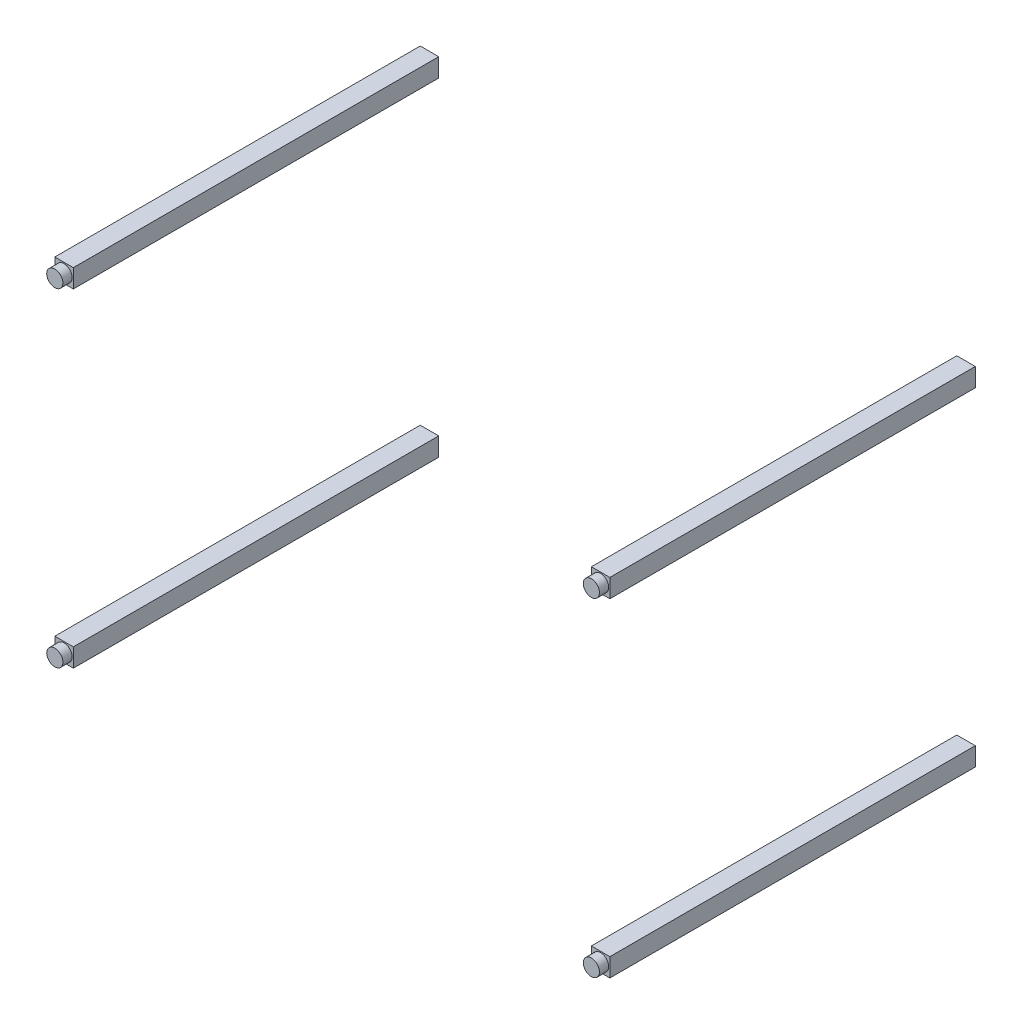
ISO-10303-21;
HEADER;
FILE_DESCRIPTION(('STEP AP214'),'2;1');
FILE_NAME('part.step','',(''),(''),'','','');
FILE_SCHEMA(('AUTOMOTIVE_DESIGN { 1 0 10303 214 1 1 1 1 }'));
ENDSEC;
DATA;
#1=APPLICATION_CONTEXT('core data for automotive mechanical design processes');
#2=APPLICATION_PROTOCOL_DEFINITION('international standard','automotive_design',2000,#1);
#3=PRODUCT_CONTEXT('',#1,'mechanical');
#4=PRODUCT('Part','Part','',(#3));
#5=PRODUCT_RELATED_PRODUCT_CATEGORY('part','',(#4));
#6=PRODUCT_DEFINITION_FORMATION('','',#4);
#7=PRODUCT_DEFINITION_CONTEXT('part definition',#1,'design');
#8=PRODUCT_DEFINITION('design','',#6,#7);
#9=PRODUCT_DEFINITION_SHAPE('','',#8);
#10=(LENGTH_UNIT() NAMED_UNIT(*) SI_UNIT(.MILLI.,.METRE.));
#11=(NAMED_UNIT(*) PLANE_ANGLE_UNIT() SI_UNIT($,.RADIAN.));
#12=(NAMED_UNIT(*) SI_UNIT($,.STERADIAN.) SOLID_ANGLE_UNIT());
#13=UNCERTAINTY_MEASURE_WITH_UNIT(LENGTH_MEASURE(1.E-05),#10,'distance_accuracy_value','');
#14=(GEOMETRIC_REPRESENTATION_CONTEXT(3) GLOBAL_UNCERTAINTY_ASSIGNED_CONTEXT((#13)) GLOBAL_UNIT_ASSIGNED_CONTEXT((#10,
#11,#12)) REPRESENTATION_CONTEXT('',''));
#15=CARTESIAN_POINT('',(0.,0.,0.));
#16=DIRECTION('',(0.,0.,1.));
#17=DIRECTION('',(1.,0.,0.));
#18=AXIS2_PLACEMENT_3D('',#15,#16,#17);
#19=CARTESIAN_POINT('',(-600.,-375.,829.000000000004));
#20=DIRECTION('',(1.,0.,0.));
#21=DIRECTION('',(0.,0.,-1.));
#22=AXIS2_PLACEMENT_3D('',#19,#20,#21);
#23=PLANE('',#22);
#24=DIRECTION('',(0.,-1.,0.));
#25=VECTOR('',#24,1.);
#26=CARTESIAN_POINT('',(-600.,-375.,39.0000000000037));
#27=LINE('',#26,#25);
#28=CARTESIAN_POINT('',(-600.,-335.,39.0000000000037));
#29=VERTEX_POINT('',#28);
#30=CARTESIAN_POINT('',(-600.,-375.,39.0000000000037));
#31=VERTEX_POINT('',#30);
#32=EDGE_CURVE('E59',#29,#31,#27,.T.);
#33=ORIENTED_EDGE('',*,*,#32,.T.);
#34=DIRECTION('',(0.,0.,-1.));
#35=VECTOR('',#34,1.);
#36=CARTESIAN_POINT('',(-600.,-375.,829.000000000004));
#37=LINE('',#36,#35);
#38=CARTESIAN_POINT('',(-600.,-375.,829.000000000004));
#39=VERTEX_POINT('',#38);
#40=EDGE_CURVE('E123',#39,#31,#37,.T.);
#41=ORIENTED_EDGE('',*,*,#40,.F.);
#42=DIRECTION('',(0.,-1.,0.));
#43=VECTOR('',#42,1.);
#44=CARTESIAN_POINT('',(-600.,-375.,829.000000000004));
#45=LINE('',#44,#43);
#46=CARTESIAN_POINT('',(-600.,-335.,829.000000000004));
#47=VERTEX_POINT('',#46);
#48=EDGE_CURVE('E53',#47,#39,#45,.T.);
#49=ORIENTED_EDGE('',*,*,#48,.F.);
#50=DIRECTION('',(0.,0.,-1.));
#51=VECTOR('',#50,1.);
#52=CARTESIAN_POINT('',(-600.,-335.,829.000000000004));
#53=LINE('',#52,#51);
#54=EDGE_CURVE('E109',#47,#29,#53,.T.);
#55=ORIENTED_EDGE('',*,*,#54,.T.);
#56=EDGE_LOOP('',(#33,#41,#49,#55));
#57=FACE_BOUND('',#56,.T.);
#58=ADVANCED_FACE('F49',(#57),#23,.F.);
#59=CARTESIAN_POINT('',(-600.,-375.,829.000000000004));
#60=DIRECTION('',(0.,1.,0.));
#61=DIRECTION('',(0.,0.,1.));
#62=AXIS2_PLACEMENT_3D('',#59,#60,#61);
#63=PLANE('',#62);
#64=DIRECTION('',(1.,0.,0.));
#65=VECTOR('',#64,1.);
#66=CARTESIAN_POINT('',(-600.,-375.,39.0000000000037));
#67=LINE('',#66,#65);
#68=CARTESIAN_POINT('',(-560.,-375.,39.0000000000037));
#69=VERTEX_POINT('',#68);
#70=EDGE_CURVE('E68',#31,#69,#67,.T.);
#71=ORIENTED_EDGE('',*,*,#70,.T.);
#72=DIRECTION('',(0.,0.,-1.));
#73=VECTOR('',#72,1.);
#74=CARTESIAN_POINT('',(-560.,-375.,829.000000000004));
#75=LINE('',#74,#73);
#76=CARTESIAN_POINT('',(-560.,-375.,829.000000000004));
#77=VERTEX_POINT('',#76);
#78=EDGE_CURVE('E105',#77,#69,#75,.T.);
#79=ORIENTED_EDGE('',*,*,#78,.F.);
#80=DIRECTION('',(1.,0.,0.));
#81=VECTOR('',#80,1.);
#82=CARTESIAN_POINT('',(-600.,-375.,829.000000000004));
#83=LINE('',#82,#81);
#84=EDGE_CURVE('E84',#39,#77,#83,.T.);
#85=ORIENTED_EDGE('',*,*,#84,.F.);
#86=ORIENTED_EDGE('',*,*,#40,.T.);
#87=EDGE_LOOP('',(#71,#79,#85,#86));
#88=FACE_BOUND('',#87,.T.);
#89=ADVANCED_FACE('F146',(#88),#63,.F.);
#90=CARTESIAN_POINT('',(-560.,-375.,829.000000000004));
#91=DIRECTION('',(-1.,0.,0.));
#92=DIRECTION('',(0.,0.,1.));
#93=AXIS2_PLACEMENT_3D('',#90,#91,#92);
#94=PLANE('',#93);
#95=DIRECTION('',(0.,1.,0.));
#96=VECTOR('',#95,1.);
#97=CARTESIAN_POINT('',(-560.,-375.,39.0000000000037));
#98=LINE('',#97,#96);
#99=CARTESIAN_POINT('',(-560.,-335.,39.0000000000037));
#100=VERTEX_POINT('',#99);
#101=EDGE_CURVE('E100',#69,#100,#98,.T.);
#102=ORIENTED_EDGE('',*,*,#101,.T.);
#103=DIRECTION('',(0.,0.,-1.));
#104=VECTOR('',#103,1.);
#105=CARTESIAN_POINT('',(-560.,-335.,829.000000000004));
#106=LINE('',#105,#104);
#107=CARTESIAN_POINT('',(-560.,-335.,829.000000000004));
#108=VERTEX_POINT('',#107);
#109=EDGE_CURVE('E103',#108,#100,#106,.T.);
#110=ORIENTED_EDGE('',*,*,#109,.F.);
#111=DIRECTION('',(0.,1.,0.));
#112=VECTOR('',#111,1.);
#113=CARTESIAN_POINT('',(-560.,-375.,829.000000000004));
#114=LINE('',#113,#112);
#115=EDGE_CURVE('E119',#77,#108,#114,.T.);
#116=ORIENTED_EDGE('',*,*,#115,.F.);
#117=ORIENTED_EDGE('',*,*,#78,.T.);
#118=EDGE_LOOP('',(#102,#110,#116,#117));
#119=FACE_BOUND('',#118,.T.);
#120=ADVANCED_FACE('F101',(#119),#94,.F.);
#121=CARTESIAN_POINT('',(-600.,-335.,829.000000000004));
#122=DIRECTION('',(0.,-1.,0.));
#123=DIRECTION('',(0.,0.,-1.));
#124=AXIS2_PLACEMENT_3D('',#121,#122,#123);
#125=PLANE('',#124);
#126=DIRECTION('',(-1.,0.,0.));
#127=VECTOR('',#126,1.);
#128=CARTESIAN_POINT('',(-600.,-335.,39.0000000000037));
#129=LINE('',#128,#127);
#130=EDGE_CURVE('E94',#100,#29,#129,.T.);
#131=ORIENTED_EDGE('',*,*,#130,.T.);
#132=ORIENTED_EDGE('',*,*,#54,.F.);
#133=DIRECTION('',(-1.,0.,0.));
#134=VECTOR('',#133,1.);
#135=CARTESIAN_POINT('',(-600.,-335.,829.000000000004));
#136=LINE('',#135,#134);
#137=EDGE_CURVE('E108',#108,#47,#136,.T.);
#138=ORIENTED_EDGE('',*,*,#137,.F.);
#139=ORIENTED_EDGE('',*,*,#109,.T.);
#140=EDGE_LOOP('',(#131,#132,#138,#139));
#141=FACE_BOUND('',#140,.T.);
#142=ADVANCED_FACE('F107',(#141),#125,.F.);
#143=CARTESIAN_POINT('',(0.,0.,829.000000000004));
#144=DIRECTION('',(0.,0.,-1.));
#145=DIRECTION('',(-1.,0.,0.));
#146=AXIS2_PLACEMENT_3D('',#143,#144,#145);
#147=PLANE('',#146);
#148=CARTESIAN_POINT('',(-580.,-355.,829.000000000004));
#149=DIRECTION('',(0.,0.,1.));
#150=DIRECTION('',(-1.,0.,0.));
#151=AXIS2_PLACEMENT_3D('',#148,#149,#150);
#152=CIRCLE('',#151,17.4999999999999);
#153=CARTESIAN_POINT('',(-597.5,-355.,829.000000000004));
#154=VERTEX_POINT('',#153);
#155=EDGE_CURVE('E12',#154,#154,#152,.T.);
#156=ORIENTED_EDGE('',*,*,#155,.F.);
#157=EDGE_LOOP('',(#156));
#158=FACE_BOUND('',#157,.T.);
#159=ORIENTED_EDGE('',*,*,#48,.T.);
#160=ORIENTED_EDGE('',*,*,#84,.T.);
#161=ORIENTED_EDGE('',*,*,#115,.T.);
#162=ORIENTED_EDGE('',*,*,#137,.T.);
#163=EDGE_LOOP('',(#159,#160,#161,#162));
#164=FACE_BOUND('',#163,.T.);
#165=ADVANCED_FACE('F51',(#158,#164),#147,.F.);
#166=CARTESIAN_POINT('',(0.,0.,39.0000000000037));
#167=DIRECTION('',(0.,0.,-1.));
#168=DIRECTION('',(-1.,0.,0.));
#169=AXIS2_PLACEMENT_3D('',#166,#167,#168);
#170=PLANE('',#169);
#171=ORIENTED_EDGE('',*,*,#32,.F.);
#172=ORIENTED_EDGE('',*,*,#130,.F.);
#173=ORIENTED_EDGE('',*,*,#101,.F.);
#174=ORIENTED_EDGE('',*,*,#70,.F.);
#175=EDGE_LOOP('',(#171,#172,#173,#174));
#176=FACE_BOUND('',#175,.T.);
#177=ADVANCED_FACE('F111',(#176),#170,.T.);
#178=CARTESIAN_POINT('',(-580.,-355.,849.000000000004));
#179=DIRECTION('',(0.,0.,-1.));
#180=DIRECTION('',(-1.,0.,0.));
#181=AXIS2_PLACEMENT_3D('',#178,#179,#180);
#182=CYLINDRICAL_SURFACE('',#181,17.4999999999999);
#183=CARTESIAN_POINT('',(-580.,-355.,849.000000000004));
#184=DIRECTION('',(0.,0.,1.));
#185=DIRECTION('',(-1.,0.,0.));
#186=AXIS2_PLACEMENT_3D('',#183,#184,#185);
#187=CIRCLE('',#186,17.4999999999999);
#188=CARTESIAN_POINT('',(-597.5,-355.,849.000000000004));
#189=VERTEX_POINT('',#188);
#190=EDGE_CURVE('E124',#189,#189,#187,.T.);
#191=ORIENTED_EDGE('',*,*,#190,.F.);
#192=EDGE_LOOP('',(#191));
#193=FACE_BOUND('',#192,.T.);
#194=ORIENTED_EDGE('',*,*,#155,.T.);
#195=EDGE_LOOP('',(#194));
#196=FACE_BOUND('',#195,.T.);
#197=ADVANCED_FACE('F133',(#193,#196),#182,.T.);
#198=CARTESIAN_POINT('',(-580.,-355.,849.000000000004));
#199=DIRECTION('',(0.,0.,-1.));
#200=DIRECTION('',(-1.,0.,0.));
#201=AXIS2_PLACEMENT_3D('',#198,#199,#200);
#202=PLANE('',#201);
#203=ORIENTED_EDGE('',*,*,#190,.T.);
#204=EDGE_LOOP('',(#203));
#205=FACE_BOUND('',#204,.T.);
#206=ADVANCED_FACE('F131',(#205),#202,.F.);
#207=CLOSED_SHELL('',(#58,#89,#120,#142,#165,#177,#197,#206));
#208=MANIFOLD_SOLID_BREP('B2',#207);
#209=CARTESIAN_POINT('',(600.,-375.,829.000000000004));
#210=DIRECTION('',(0.,1.,0.));
#211=DIRECTION('',(0.,0.,1.));
#212=AXIS2_PLACEMENT_3D('',#209,#210,#211);
#213=PLANE('',#212);
#214=DIRECTION('',(1.,0.,0.));
#215=VECTOR('',#214,1.);
#216=CARTESIAN_POINT('',(600.,-375.,39.0000000000037));
#217=LINE('',#216,#215);
#218=CARTESIAN_POINT('',(560.,-375.,39.0000000000037));
#219=VERTEX_POINT('',#218);
#220=CARTESIAN_POINT('',(600.,-375.,39.0000000000037));
#221=VERTEX_POINT('',#220);
#222=EDGE_CURVE('E238',#219,#221,#217,.T.);
#223=ORIENTED_EDGE('',*,*,#222,.T.);
#224=DIRECTION('',(0.,0.,-1.));
#225=VECTOR('',#224,1.);
#226=CARTESIAN_POINT('',(600.,-375.,829.000000000004));
#227=LINE('',#226,#225);
#228=CARTESIAN_POINT('',(600.,-375.,829.000000000004));
#229=VERTEX_POINT('',#228);
#230=EDGE_CURVE('E302',#229,#221,#227,.T.);
#231=ORIENTED_EDGE('',*,*,#230,.F.);
#232=DIRECTION('',(1.,0.,0.));
#233=VECTOR('',#232,1.);
#234=CARTESIAN_POINT('',(600.,-375.,829.000000000004));
#235=LINE('',#234,#233);
#236=CARTESIAN_POINT('',(560.,-375.,829.000000000004));
#237=VERTEX_POINT('',#236);
#238=EDGE_CURVE('E232',#237,#229,#235,.T.);
#239=ORIENTED_EDGE('',*,*,#238,.F.);
#240=DIRECTION('',(0.,0.,-1.));
#241=VECTOR('',#240,1.);
#242=CARTESIAN_POINT('',(560.,-375.,829.000000000004));
#243=LINE('',#242,#241);
#244=EDGE_CURVE('E288',#237,#219,#243,.T.);
#245=ORIENTED_EDGE('',*,*,#244,.T.);
#246=EDGE_LOOP('',(#223,#231,#239,#245));
#247=FACE_BOUND('',#246,.T.);
#248=ADVANCED_FACE('F228',(#247),#213,.F.);
#249=CARTESIAN_POINT('',(600.,-375.,829.000000000004));
#250=DIRECTION('',(-1.,0.,0.));
#251=DIRECTION('',(0.,0.,1.));
#252=AXIS2_PLACEMENT_3D('',#249,#250,#251);
#253=PLANE('',#252);
#254=DIRECTION('',(0.,1.,0.));
#255=VECTOR('',#254,1.);
#256=CARTESIAN_POINT('',(600.,-375.,39.0000000000037));
#257=LINE('',#256,#255);
#258=CARTESIAN_POINT('',(600.,-335.,39.0000000000037));
#259=VERTEX_POINT('',#258);
#260=EDGE_CURVE('E247',#221,#259,#257,.T.);
#261=ORIENTED_EDGE('',*,*,#260,.T.);
#262=DIRECTION('',(0.,0.,-1.));
#263=VECTOR('',#262,1.);
#264=CARTESIAN_POINT('',(600.,-335.,829.000000000004));
#265=LINE('',#264,#263);
#266=CARTESIAN_POINT('',(600.,-335.,829.000000000004));
#267=VERTEX_POINT('',#266);
#268=EDGE_CURVE('E284',#267,#259,#265,.T.);
#269=ORIENTED_EDGE('',*,*,#268,.F.);
#270=DIRECTION('',(0.,1.,0.));
#271=VECTOR('',#270,1.);
#272=CARTESIAN_POINT('',(600.,-375.,829.000000000004));
#273=LINE('',#272,#271);
#274=EDGE_CURVE('E263',#229,#267,#273,.T.);
#275=ORIENTED_EDGE('',*,*,#274,.F.);
#276=ORIENTED_EDGE('',*,*,#230,.T.);
#277=EDGE_LOOP('',(#261,#269,#275,#276));
#278=FACE_BOUND('',#277,.T.);
#279=ADVANCED_FACE('F325',(#278),#253,.F.);
#280=CARTESIAN_POINT('',(600.,-335.,829.000000000004));
#281=DIRECTION('',(0.,-1.,0.));
#282=DIRECTION('',(0.,0.,-1.));
#283=AXIS2_PLACEMENT_3D('',#280,#281,#282);
#284=PLANE('',#283);
#285=DIRECTION('',(-1.,0.,0.));
#286=VECTOR('',#285,1.);
#287=CARTESIAN_POINT('',(600.,-335.,39.0000000000037));
#288=LINE('',#287,#286);
#289=CARTESIAN_POINT('',(560.,-335.,39.0000000000037));
#290=VERTEX_POINT('',#289);
#291=EDGE_CURVE('E279',#259,#290,#288,.T.);
#292=ORIENTED_EDGE('',*,*,#291,.T.);
#293=DIRECTION('',(0.,0.,-1.));
#294=VECTOR('',#293,1.);
#295=CARTESIAN_POINT('',(560.,-335.,829.000000000004));
#296=LINE('',#295,#294);
#297=CARTESIAN_POINT('',(560.,-335.,829.000000000004));
#298=VERTEX_POINT('',#297);
#299=EDGE_CURVE('E282',#298,#290,#296,.T.);
#300=ORIENTED_EDGE('',*,*,#299,.F.);
#301=DIRECTION('',(-1.,0.,0.));
#302=VECTOR('',#301,1.);
#303=CARTESIAN_POINT('',(600.,-335.,829.000000000004));
#304=LINE('',#303,#302);
#305=EDGE_CURVE('E298',#267,#298,#304,.T.);
#306=ORIENTED_EDGE('',*,*,#305,.F.);
#307=ORIENTED_EDGE('',*,*,#268,.T.);
#308=EDGE_LOOP('',(#292,#300,#306,#307));
#309=FACE_BOUND('',#308,.T.);
#310=ADVANCED_FACE('F280',(#309),#284,.F.);
#311=CARTESIAN_POINT('',(560.,-375.,829.000000000004));
#312=DIRECTION('',(1.,0.,0.));
#313=DIRECTION('',(0.,0.,-1.));
#314=AXIS2_PLACEMENT_3D('',#311,#312,#313);
#315=PLANE('',#314);
#316=DIRECTION('',(0.,-1.,0.));
#317=VECTOR('',#316,1.);
#318=CARTESIAN_POINT('',(560.,-375.,39.0000000000037));
#319=LINE('',#318,#317);
#320=EDGE_CURVE('E273',#290,#219,#319,.T.);
#321=ORIENTED_EDGE('',*,*,#320,.T.);
#322=ORIENTED_EDGE('',*,*,#244,.F.);
#323=DIRECTION('',(0.,-1.,0.));
#324=VECTOR('',#323,1.);
#325=CARTESIAN_POINT('',(560.,-375.,829.000000000004));
#326=LINE('',#325,#324);
#327=EDGE_CURVE('E287',#298,#237,#326,.T.);
#328=ORIENTED_EDGE('',*,*,#327,.F.);
#329=ORIENTED_EDGE('',*,*,#299,.T.);
#330=EDGE_LOOP('',(#321,#322,#328,#329));
#331=FACE_BOUND('',#330,.T.);
#332=ADVANCED_FACE('F286',(#331),#315,.F.);
#333=CARTESIAN_POINT('',(0.,0.,829.000000000004));
#334=DIRECTION('',(0.,0.,-1.));
#335=DIRECTION('',(-1.,0.,0.));
#336=AXIS2_PLACEMENT_3D('',#333,#334,#335);
#337=PLANE('',#336);
#338=CARTESIAN_POINT('',(580.,-355.,829.000000000004));
#339=DIRECTION('',(0.,0.,1.));
#340=DIRECTION('',(1.,0.,0.));
#341=AXIS2_PLACEMENT_3D('',#338,#339,#340);
#342=CIRCLE('',#341,17.4999999999999);
#343=CARTESIAN_POINT('',(597.5,-355.,829.000000000004));
#344=VERTEX_POINT('',#343);
#345=EDGE_CURVE('E47',#344,#344,#342,.T.);
#346=ORIENTED_EDGE('',*,*,#345,.F.);
#347=EDGE_LOOP('',(#346));
#348=FACE_BOUND('',#347,.T.);
#349=ORIENTED_EDGE('',*,*,#238,.T.);
#350=ORIENTED_EDGE('',*,*,#274,.T.);
#351=ORIENTED_EDGE('',*,*,#305,.T.);
#352=ORIENTED_EDGE('',*,*,#327,.T.);
#353=EDGE_LOOP('',(#349,#350,#351,#352));
#354=FACE_BOUND('',#353,.T.);
#355=ADVANCED_FACE('F230',(#348,#354),#337,.F.);
#356=CARTESIAN_POINT('',(0.,0.,39.0000000000037));
#357=DIRECTION('',(0.,0.,-1.));
#358=DIRECTION('',(-1.,0.,0.));
#359=AXIS2_PLACEMENT_3D('',#356,#357,#358);
#360=PLANE('',#359);
#361=ORIENTED_EDGE('',*,*,#222,.F.);
#362=ORIENTED_EDGE('',*,*,#320,.F.);
#363=ORIENTED_EDGE('',*,*,#291,.F.);
#364=ORIENTED_EDGE('',*,*,#260,.F.);
#365=EDGE_LOOP('',(#361,#362,#363,#364));
#366=FACE_BOUND('',#365,.T.);
#367=ADVANCED_FACE('F290',(#366),#360,.T.);
#368=CARTESIAN_POINT('',(580.,-355.,849.000000000004));
#369=DIRECTION('',(0.,0.,-1.));
#370=DIRECTION('',(-1.,0.,0.));
#371=AXIS2_PLACEMENT_3D('',#368,#369,#370);
#372=CYLINDRICAL_SURFACE('',#371,17.4999999999999);
#373=CARTESIAN_POINT('',(580.,-355.,849.000000000004));
#374=DIRECTION('',(0.,0.,1.));
#375=DIRECTION('',(1.,0.,0.));
#376=AXIS2_PLACEMENT_3D('',#373,#374,#375);
#377=CIRCLE('',#376,17.4999999999999);
#378=CARTESIAN_POINT('',(597.5,-355.,849.000000000004));
#379=VERTEX_POINT('',#378);
#380=EDGE_CURVE('E303',#379,#379,#377,.T.);
#381=ORIENTED_EDGE('',*,*,#380,.F.);
#382=EDGE_LOOP('',(#381));
#383=FACE_BOUND('',#382,.T.);
#384=ORIENTED_EDGE('',*,*,#345,.T.);
#385=EDGE_LOOP('',(#384));
#386=FACE_BOUND('',#385,.T.);
#387=ADVANCED_FACE('F312',(#383,#386),#372,.T.);
#388=CARTESIAN_POINT('',(580.,-355.,849.000000000004));
#389=DIRECTION('',(0.,0.,1.));
#390=DIRECTION('',(1.,0.,0.));
#391=AXIS2_PLACEMENT_3D('',#388,#389,#390);
#392=PLANE('',#391);
#393=ORIENTED_EDGE('',*,*,#380,.T.);
#394=EDGE_LOOP('',(#393));
#395=FACE_BOUND('',#394,.T.);
#396=ADVANCED_FACE('F310',(#395),#392,.T.);
#397=CLOSED_SHELL('',(#248,#279,#310,#332,#355,#367,#387,#396));
#398=MANIFOLD_SOLID_BREP('B6',#397);
#399=CARTESIAN_POINT('',(600.,375.,829.000000000004));
#400=DIRECTION('',(-1.,0.,0.));
#401=DIRECTION('',(0.,0.,1.));
#402=AXIS2_PLACEMENT_3D('',#399,#400,#401);
#403=PLANE('',#402);
#404=DIRECTION('',(0.,1.,0.));
#405=VECTOR('',#404,1.);
#406=CARTESIAN_POINT('',(600.,375.,39.0000000000037));
#407=LINE('',#406,#405);
#408=CARTESIAN_POINT('',(600.,335.,39.0000000000037));
#409=VERTEX_POINT('',#408);
#410=CARTESIAN_POINT('',(600.,375.,39.0000000000037));
#411=VERTEX_POINT('',#410);
#412=EDGE_CURVE('E416',#409,#411,#407,.T.);
#413=ORIENTED_EDGE('',*,*,#412,.T.);
#414=DIRECTION('',(0.,0.,-1.));
#415=VECTOR('',#414,1.);
#416=CARTESIAN_POINT('',(600.,375.,829.000000000004));
#417=LINE('',#416,#415);
#418=CARTESIAN_POINT('',(600.,375.,829.000000000004));
#419=VERTEX_POINT('',#418);
#420=EDGE_CURVE('E480',#419,#411,#417,.T.);
#421=ORIENTED_EDGE('',*,*,#420,.F.);
#422=DIRECTION('',(0.,1.,0.));
#423=VECTOR('',#422,1.);
#424=CARTESIAN_POINT('',(600.,375.,829.000000000004));
#425=LINE('',#424,#423);
#426=CARTESIAN_POINT('',(600.,335.,829.000000000004));
#427=VERTEX_POINT('',#426);
#428=EDGE_CURVE('E410',#427,#419,#425,.T.);
#429=ORIENTED_EDGE('',*,*,#428,.F.);
#430=DIRECTION('',(0.,0.,-1.));
#431=VECTOR('',#430,1.);
#432=CARTESIAN_POINT('',(600.,335.,829.000000000004));
#433=LINE('',#432,#431);
#434=EDGE_CURVE('E466',#427,#409,#433,.T.);
#435=ORIENTED_EDGE('',*,*,#434,.T.);
#436=EDGE_LOOP('',(#413,#421,#429,#435));
#437=FACE_BOUND('',#436,.T.);
#438=ADVANCED_FACE('F406',(#437),#403,.F.);
#439=CARTESIAN_POINT('',(600.,375.,829.000000000004));
#440=DIRECTION('',(0.,-1.,0.));
#441=DIRECTION('',(0.,0.,-1.));
#442=AXIS2_PLACEMENT_3D('',#439,#440,#441);
#443=PLANE('',#442);
#444=DIRECTION('',(-1.,0.,0.));
#445=VECTOR('',#444,1.);
#446=CARTESIAN_POINT('',(600.,375.,39.0000000000037));
#447=LINE('',#446,#445);
#448=CARTESIAN_POINT('',(560.,375.,39.0000000000037));
#449=VERTEX_POINT('',#448);
#450=EDGE_CURVE('E425',#411,#449,#447,.T.);
#451=ORIENTED_EDGE('',*,*,#450,.T.);
#452=DIRECTION('',(0.,0.,-1.));
#453=VECTOR('',#452,1.);
#454=CARTESIAN_POINT('',(560.,375.,829.000000000004));
#455=LINE('',#454,#453);
#456=CARTESIAN_POINT('',(560.,375.,829.000000000004));
#457=VERTEX_POINT('',#456);
#458=EDGE_CURVE('E462',#457,#449,#455,.T.);
#459=ORIENTED_EDGE('',*,*,#458,.F.);
#460=DIRECTION('',(-1.,0.,0.));
#461=VECTOR('',#460,1.);
#462=CARTESIAN_POINT('',(600.,375.,829.000000000004));
#463=LINE('',#462,#461);
#464=EDGE_CURVE('E441',#419,#457,#463,.T.);
#465=ORIENTED_EDGE('',*,*,#464,.F.);
#466=ORIENTED_EDGE('',*,*,#420,.T.);
#467=EDGE_LOOP('',(#451,#459,#465,#466));
#468=FACE_BOUND('',#467,.T.);
#469=ADVANCED_FACE('F503',(#468),#443,.F.);
#470=CARTESIAN_POINT('',(560.,375.,829.000000000004));
#471=DIRECTION('',(1.,0.,0.));
#472=DIRECTION('',(0.,0.,-1.));
#473=AXIS2_PLACEMENT_3D('',#470,#471,#472);
#474=PLANE('',#473);
#475=DIRECTION('',(0.,-1.,0.));
#476=VECTOR('',#475,1.);
#477=CARTESIAN_POINT('',(560.,375.,39.0000000000037));
#478=LINE('',#477,#476);
#479=CARTESIAN_POINT('',(560.,335.,39.0000000000037));
#480=VERTEX_POINT('',#479);
#481=EDGE_CURVE('E457',#449,#480,#478,.T.);
#482=ORIENTED_EDGE('',*,*,#481,.T.);
#483=DIRECTION('',(0.,0.,-1.));
#484=VECTOR('',#483,1.);
#485=CARTESIAN_POINT('',(560.,335.,829.000000000004));
#486=LINE('',#485,#484);
#487=CARTESIAN_POINT('',(560.,335.,829.000000000004));
#488=VERTEX_POINT('',#487);
#489=EDGE_CURVE('E460',#488,#480,#486,.T.);
#490=ORIENTED_EDGE('',*,*,#489,.F.);
#491=DIRECTION('',(0.,-1.,0.));
#492=VECTOR('',#491,1.);
#493=CARTESIAN_POINT('',(560.,375.,829.000000000004));
#494=LINE('',#493,#492);
#495=EDGE_CURVE('E476',#457,#488,#494,.T.);
#496=ORIENTED_EDGE('',*,*,#495,.F.);
#497=ORIENTED_EDGE('',*,*,#458,.T.);
#498=EDGE_LOOP('',(#482,#490,#496,#497));
#499=FACE_BOUND('',#498,.T.);
#500=ADVANCED_FACE('F458',(#499),#474,.F.);
#501=CARTESIAN_POINT('',(600.,335.,829.000000000004));
#502=DIRECTION('',(0.,1.,0.));
#503=DIRECTION('',(0.,0.,1.));
#504=AXIS2_PLACEMENT_3D('',#501,#502,#503);
#505=PLANE('',#504);
#506=DIRECTION('',(1.,0.,0.));
#507=VECTOR('',#506,1.);
#508=CARTESIAN_POINT('',(600.,335.,39.0000000000037));
#509=LINE('',#508,#507);
#510=EDGE_CURVE('E451',#480,#409,#509,.T.);
#511=ORIENTED_EDGE('',*,*,#510,.T.);
#512=ORIENTED_EDGE('',*,*,#434,.F.);
#513=DIRECTION('',(1.,0.,0.));
#514=VECTOR('',#513,1.);
#515=CARTESIAN_POINT('',(600.,335.,829.000000000004));
#516=LINE('',#515,#514);
#517=EDGE_CURVE('E465',#488,#427,#516,.T.);
#518=ORIENTED_EDGE('',*,*,#517,.F.);
#519=ORIENTED_EDGE('',*,*,#489,.T.);
#520=EDGE_LOOP('',(#511,#512,#518,#519));
#521=FACE_BOUND('',#520,.T.);
#522=ADVANCED_FACE('F464',(#521),#505,.F.);
#523=CARTESIAN_POINT('',(0.,0.,829.000000000004));
#524=DIRECTION('',(0.,0.,-1.));
#525=DIRECTION('',(-1.,0.,0.));
#526=AXIS2_PLACEMENT_3D('',#523,#524,#525);
#527=PLANE('',#526);
#528=CARTESIAN_POINT('',(580.,355.,829.000000000004));
#529=DIRECTION('',(0.,0.,1.));
#530=DIRECTION('',(-1.,0.,0.));
#531=AXIS2_PLACEMENT_3D('',#528,#529,#530);
#532=CIRCLE('',#531,17.4999999999999);
#533=CARTESIAN_POINT('',(562.5,355.,829.000000000004));
#534=VERTEX_POINT('',#533);
#535=EDGE_CURVE('E226',#534,#534,#532,.T.);
#536=ORIENTED_EDGE('',*,*,#535,.F.);
#537=EDGE_LOOP('',(#536));
#538=FACE_BOUND('',#537,.T.);
#539=ORIENTED_EDGE('',*,*,#428,.T.);
#540=ORIENTED_EDGE('',*,*,#464,.T.);
#541=ORIENTED_EDGE('',*,*,#495,.T.);
#542=ORIENTED_EDGE('',*,*,#517,.T.);
#543=EDGE_LOOP('',(#539,#540,#541,#542));
#544=FACE_BOUND('',#543,.T.);
#545=ADVANCED_FACE('F408',(#538,#544),#527,.F.);
#546=CARTESIAN_POINT('',(0.,0.,39.0000000000037));
#547=DIRECTION('',(0.,0.,-1.));
#548=DIRECTION('',(-1.,0.,0.));
#549=AXIS2_PLACEMENT_3D('',#546,#547,#548);
#550=PLANE('',#549);
#551=ORIENTED_EDGE('',*,*,#412,.F.);
#552=ORIENTED_EDGE('',*,*,#510,.F.);
#553=ORIENTED_EDGE('',*,*,#481,.F.);
#554=ORIENTED_EDGE('',*,*,#450,.F.);
#555=EDGE_LOOP('',(#551,#552,#553,#554));
#556=FACE_BOUND('',#555,.T.);
#557=ADVANCED_FACE('F468',(#556),#550,.T.);
#558=CARTESIAN_POINT('',(580.,355.,849.000000000004));
#559=DIRECTION('',(0.,0.,-1.));
#560=DIRECTION('',(-1.,0.,0.));
#561=AXIS2_PLACEMENT_3D('',#558,#559,#560);
#562=CYLINDRICAL_SURFACE('',#561,17.4999999999999);
#563=CARTESIAN_POINT('',(580.,355.,849.000000000004));
#564=DIRECTION('',(0.,0.,1.));
#565=DIRECTION('',(-1.,0.,0.));
#566=AXIS2_PLACEMENT_3D('',#563,#564,#565);
#567=CIRCLE('',#566,17.4999999999999);
#568=CARTESIAN_POINT('',(562.5,355.,849.000000000004));
#569=VERTEX_POINT('',#568);
#570=EDGE_CURVE('E481',#569,#569,#567,.T.);
#571=ORIENTED_EDGE('',*,*,#570,.F.);
#572=EDGE_LOOP('',(#571));
#573=FACE_BOUND('',#572,.T.);
#574=ORIENTED_EDGE('',*,*,#535,.T.);
#575=EDGE_LOOP('',(#574));
#576=FACE_BOUND('',#575,.T.);
#577=ADVANCED_FACE('F490',(#573,#576),#562,.T.);
#578=CARTESIAN_POINT('',(580.,355.,849.000000000004));
#579=DIRECTION('',(0.,0.,-1.));
#580=DIRECTION('',(-1.,0.,0.));
#581=AXIS2_PLACEMENT_3D('',#578,#579,#580);
#582=PLANE('',#581);
#583=ORIENTED_EDGE('',*,*,#570,.T.);
#584=EDGE_LOOP('',(#583));
#585=FACE_BOUND('',#584,.T.);
#586=ADVANCED_FACE('F488',(#585),#582,.F.);
#587=CLOSED_SHELL('',(#438,#469,#500,#522,#545,#557,#577,#586));
#588=MANIFOLD_SOLID_BREP('B41',#587);
#589=CARTESIAN_POINT('',(-600.,375.,829.000000000004));
#590=DIRECTION('',(1.,0.,0.));
#591=DIRECTION('',(0.,0.,-1.));
#592=AXIS2_PLACEMENT_3D('',#589,#590,#591);
#593=PLANE('',#592);
#594=DIRECTION('',(0.,-1.,0.));
#595=VECTOR('',#594,1.);
#596=CARTESIAN_POINT('',(-600.,375.,39.0000000000037));
#597=LINE('',#596,#595);
#598=CARTESIAN_POINT('',(-600.,375.,39.0000000000037));
#599=VERTEX_POINT('',#598);
#600=CARTESIAN_POINT('',(-600.,335.,39.0000000000037));
#601=VERTEX_POINT('',#600);
#602=EDGE_CURVE('E641',#599,#601,#597,.T.);
#603=ORIENTED_EDGE('',*,*,#602,.T.);
#604=DIRECTION('',(0.,0.,-1.));
#605=VECTOR('',#604,1.);
#606=CARTESIAN_POINT('',(-600.,335.,829.000000000004));
#607=LINE('',#606,#605);
#608=CARTESIAN_POINT('',(-600.,335.,829.000000000004));
#609=VERTEX_POINT('',#608);
#610=EDGE_CURVE('E578',#609,#601,#607,.T.);
#611=ORIENTED_EDGE('',*,*,#610,.F.);
#612=DIRECTION('',(0.,-1.,0.));
#613=VECTOR('',#612,1.);
#614=CARTESIAN_POINT('',(-600.,375.,829.000000000004));
#615=LINE('',#614,#613);
#616=CARTESIAN_POINT('',(-600.,375.,829.000000000004));
#617=VERTEX_POINT('',#616);
#618=EDGE_CURVE('E628',#617,#609,#615,.T.);
#619=ORIENTED_EDGE('',*,*,#618,.F.);
#620=DIRECTION('',(0.,0.,-1.));
#621=VECTOR('',#620,1.);
#622=CARTESIAN_POINT('',(-600.,375.,829.000000000004));
#623=LINE('',#622,#621);
#624=EDGE_CURVE('E637',#617,#599,#623,.T.);
#625=ORIENTED_EDGE('',*,*,#624,.T.);
#626=EDGE_LOOP('',(#603,#611,#619,#625));
#627=FACE_BOUND('',#626,.T.);
#628=ADVANCED_FACE('F575',(#627),#593,.F.);
#629=CARTESIAN_POINT('',(-600.,335.,829.000000000004));
#630=DIRECTION('',(0.,1.,0.));
#631=DIRECTION('',(0.,0.,1.));
#632=AXIS2_PLACEMENT_3D('',#629,#630,#631);
#633=PLANE('',#632);
#634=DIRECTION('',(1.,0.,0.));
#635=VECTOR('',#634,1.);
#636=CARTESIAN_POINT('',(-600.,335.,39.0000000000037));
#637=LINE('',#636,#635);
#638=CARTESIAN_POINT('',(-560.,335.,39.0000000000037));
#639=VERTEX_POINT('',#638);
#640=EDGE_CURVE('E633',#601,#639,#637,.T.);
#641=ORIENTED_EDGE('',*,*,#640,.T.);
#642=DIRECTION('',(0.,0.,-1.));
#643=VECTOR('',#642,1.);
#644=CARTESIAN_POINT('',(-560.,335.,829.000000000004));
#645=LINE('',#644,#643);
#646=CARTESIAN_POINT('',(-560.,335.,829.000000000004));
#647=VERTEX_POINT('',#646);
#648=EDGE_CURVE('E631',#647,#639,#645,.T.);
#649=ORIENTED_EDGE('',*,*,#648,.F.);
#650=DIRECTION('',(1.,0.,0.));
#651=VECTOR('',#650,1.);
#652=CARTESIAN_POINT('',(-600.,335.,829.000000000004));
#653=LINE('',#652,#651);
#654=EDGE_CURVE('E623',#609,#647,#653,.T.);
#655=ORIENTED_EDGE('',*,*,#654,.F.);
#656=ORIENTED_EDGE('',*,*,#610,.T.);
#657=EDGE_LOOP('',(#641,#649,#655,#656));
#658=FACE_BOUND('',#657,.T.);
#659=ADVANCED_FACE('F632',(#658),#633,.F.);
#660=CARTESIAN_POINT('',(-560.,375.,829.000000000004));
#661=DIRECTION('',(-1.,0.,0.));
#662=DIRECTION('',(0.,0.,1.));
#663=AXIS2_PLACEMENT_3D('',#660,#661,#662);
#664=PLANE('',#663);
#665=DIRECTION('',(0.,1.,0.));
#666=VECTOR('',#665,1.);
#667=CARTESIAN_POINT('',(-560.,375.,39.0000000000037));
#668=LINE('',#667,#666);
#669=CARTESIAN_POINT('',(-560.,375.,39.0000000000037));
#670=VERTEX_POINT('',#669);
#671=EDGE_CURVE('E609',#639,#670,#668,.T.);
#672=ORIENTED_EDGE('',*,*,#671,.T.);
#673=DIRECTION('',(0.,0.,-1.));
#674=VECTOR('',#673,1.);
#675=CARTESIAN_POINT('',(-560.,375.,829.000000000004));
#676=LINE('',#675,#674);
#677=CARTESIAN_POINT('',(-560.,375.,829.000000000004));
#678=VERTEX_POINT('',#677);
#679=EDGE_CURVE('E634',#678,#670,#676,.T.);
#680=ORIENTED_EDGE('',*,*,#679,.F.);
#681=DIRECTION('',(0.,1.,0.));
#682=VECTOR('',#681,1.);
#683=CARTESIAN_POINT('',(-560.,375.,829.000000000004));
#684=LINE('',#683,#682);
#685=EDGE_CURVE('E626',#647,#678,#684,.T.);
#686=ORIENTED_EDGE('',*,*,#685,.F.);
#687=ORIENTED_EDGE('',*,*,#648,.T.);
#688=EDGE_LOOP('',(#672,#680,#686,#687));
#689=FACE_BOUND('',#688,.T.);
#690=ADVANCED_FACE('F635',(#689),#664,.F.);
#691=CARTESIAN_POINT('',(-600.,375.,829.000000000004));
#692=DIRECTION('',(0.,-1.,0.));
#693=DIRECTION('',(0.,0.,-1.));
#694=AXIS2_PLACEMENT_3D('',#691,#692,#693);
#695=PLANE('',#694);
#696=DIRECTION('',(-1.,0.,0.));
#697=VECTOR('',#696,1.);
#698=CARTESIAN_POINT('',(-600.,375.,39.0000000000037));
#699=LINE('',#698,#697);
#700=EDGE_CURVE('E615',#670,#599,#699,.T.);
#701=ORIENTED_EDGE('',*,*,#700,.T.);
#702=ORIENTED_EDGE('',*,*,#624,.F.);
#703=DIRECTION('',(-1.,0.,0.));
#704=VECTOR('',#703,1.);
#705=CARTESIAN_POINT('',(-600.,375.,829.000000000004));
#706=LINE('',#705,#704);
#707=EDGE_CURVE('E592',#678,#617,#706,.T.);
#708=ORIENTED_EDGE('',*,*,#707,.F.);
#709=ORIENTED_EDGE('',*,*,#679,.T.);
#710=EDGE_LOOP('',(#701,#702,#708,#709));
#711=FACE_BOUND('',#710,.T.);
#712=ADVANCED_FACE('F649',(#711),#695,.F.);
#713=CARTESIAN_POINT('',(0.,0.,829.000000000004));
#714=DIRECTION('',(0.,0.,1.));
#715=DIRECTION('',(1.,0.,0.));
#716=AXIS2_PLACEMENT_3D('',#713,#714,#715);
#717=PLANE('',#716);
#718=CARTESIAN_POINT('',(-580.,355.,829.000000000004));
#719=DIRECTION('',(0.,0.,1.));
#720=DIRECTION('',(1.,0.,0.));
#721=AXIS2_PLACEMENT_3D('',#718,#719,#720);
#722=CIRCLE('',#721,17.4999999999999);
#723=CARTESIAN_POINT('',(-562.5,355.,829.000000000004));
#724=VERTEX_POINT('',#723);
#725=EDGE_CURVE('E404',#724,#724,#722,.T.);
#726=ORIENTED_EDGE('',*,*,#725,.F.);
#727=EDGE_LOOP('',(#726));
#728=FACE_BOUND('',#727,.T.);
#729=ORIENTED_EDGE('',*,*,#618,.T.);
#730=ORIENTED_EDGE('',*,*,#654,.T.);
#731=ORIENTED_EDGE('',*,*,#685,.T.);
#732=ORIENTED_EDGE('',*,*,#707,.T.);
#733=EDGE_LOOP('',(#729,#730,#731,#732));
#734=FACE_BOUND('',#733,.T.);
#735=ADVANCED_FACE('F624',(#728,#734),#717,.T.);
#736=CARTESIAN_POINT('',(0.,0.,39.0000000000037));
#737=DIRECTION('',(0.,0.,1.));
#738=DIRECTION('',(1.,0.,0.));
#739=AXIS2_PLACEMENT_3D('',#736,#737,#738);
#740=PLANE('',#739);
#741=ORIENTED_EDGE('',*,*,#602,.F.);
#742=ORIENTED_EDGE('',*,*,#700,.F.);
#743=ORIENTED_EDGE('',*,*,#671,.F.);
#744=ORIENTED_EDGE('',*,*,#640,.F.);
#745=EDGE_LOOP('',(#741,#742,#743,#744));
#746=FACE_BOUND('',#745,.T.);
#747=ADVANCED_FACE('F652',(#746),#740,.F.);
#748=CARTESIAN_POINT('',(-580.,355.,849.000000000004));
#749=DIRECTION('',(0.,0.,-1.));
#750=DIRECTION('',(-1.,0.,0.));
#751=AXIS2_PLACEMENT_3D('',#748,#749,#750);
#752=CYLINDRICAL_SURFACE('',#751,17.4999999999999);
#753=CARTESIAN_POINT('',(-580.,355.,849.000000000004));
#754=DIRECTION('',(0.,0.,1.));
#755=DIRECTION('',(1.,0.,0.));
#756=AXIS2_PLACEMENT_3D('',#753,#754,#755);
#757=CIRCLE('',#756,17.4999999999999);
#758=CARTESIAN_POINT('',(-562.5,355.,849.000000000004));
#759=VERTEX_POINT('',#758);
#760=EDGE_CURVE('E644',#759,#759,#757,.T.);
#761=ORIENTED_EDGE('',*,*,#760,.F.);
#762=EDGE_LOOP('',(#761));
#763=FACE_BOUND('',#762,.T.);
#764=ORIENTED_EDGE('',*,*,#725,.T.);
#765=EDGE_LOOP('',(#764));
#766=FACE_BOUND('',#765,.T.);
#767=ADVANCED_FACE('F660',(#763,#766),#752,.T.);
#768=CARTESIAN_POINT('',(-580.,355.,849.000000000004));
#769=DIRECTION('',(0.,0.,1.));
#770=DIRECTION('',(1.,0.,0.));
#771=AXIS2_PLACEMENT_3D('',#768,#769,#770);
#772=PLANE('',#771);
#773=ORIENTED_EDGE('',*,*,#760,.T.);
#774=EDGE_LOOP('',(#773));
#775=FACE_BOUND('',#774,.T.);
#776=ADVANCED_FACE('F658',(#775),#772,.T.);
#777=CLOSED_SHELL('',(#628,#659,#690,#712,#735,#747,#767,#776));
#778=MANIFOLD_SOLID_BREP('B220',#777);
#779=ADVANCED_BREP_SHAPE_REPRESENTATION('',(#18,#208,#398,#588,#778),#14);
#780=SHAPE_DEFINITION_REPRESENTATION(#9,#779);
ENDSEC;
END-ISO-10303-21;
